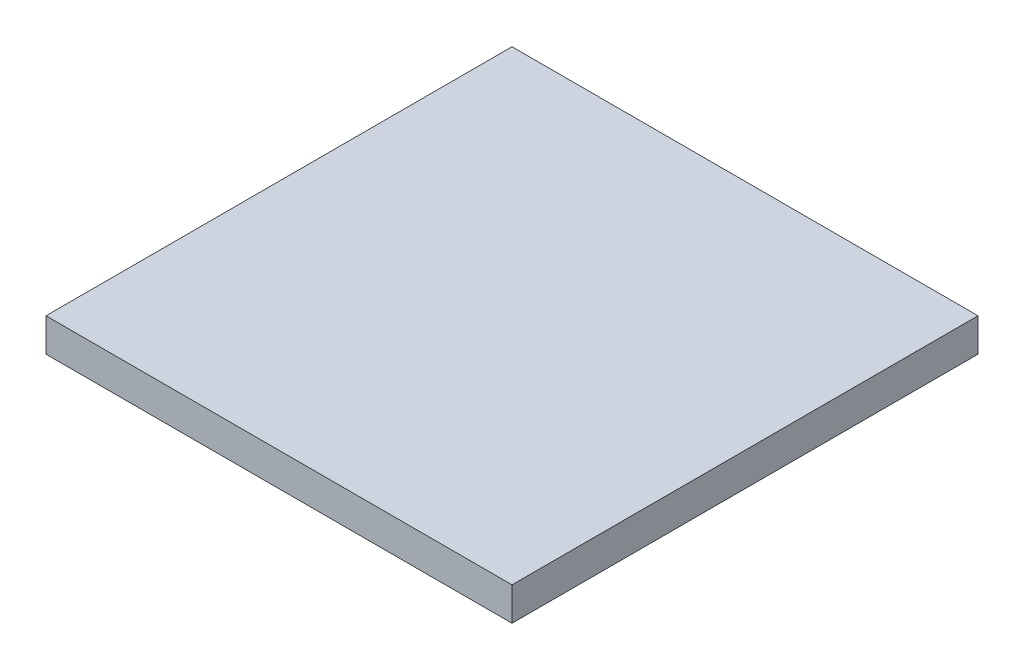
ISO-10303-21;
HEADER;
FILE_DESCRIPTION(('STEP AP214'),'2;1');
FILE_NAME('part.step','',(''),(''),'','','');
FILE_SCHEMA(('AUTOMOTIVE_DESIGN { 1 0 10303 214 1 1 1 1 }'));
ENDSEC;
DATA;
#1=APPLICATION_CONTEXT('core data for automotive mechanical design processes');
#2=APPLICATION_PROTOCOL_DEFINITION('international standard','automotive_design',2000,#1);
#3=PRODUCT_CONTEXT('',#1,'mechanical');
#4=PRODUCT('Part','Part','',(#3));
#5=PRODUCT_RELATED_PRODUCT_CATEGORY('part','',(#4));
#6=PRODUCT_DEFINITION_FORMATION('','',#4);
#7=PRODUCT_DEFINITION_CONTEXT('part definition',#1,'design');
#8=PRODUCT_DEFINITION('design','',#6,#7);
#9=PRODUCT_DEFINITION_SHAPE('','',#8);
#10=(LENGTH_UNIT() NAMED_UNIT(*) SI_UNIT(.MILLI.,.METRE.));
#11=(NAMED_UNIT(*) PLANE_ANGLE_UNIT() SI_UNIT($,.RADIAN.));
#12=(NAMED_UNIT(*) SI_UNIT($,.STERADIAN.) SOLID_ANGLE_UNIT());
#13=UNCERTAINTY_MEASURE_WITH_UNIT(LENGTH_MEASURE(1.E-05),#10,'distance_accuracy_value','');
#14=(GEOMETRIC_REPRESENTATION_CONTEXT(3) GLOBAL_UNCERTAINTY_ASSIGNED_CONTEXT((#13)) GLOBAL_UNIT_ASSIGNED_CONTEXT((#10,
#11,#12)) REPRESENTATION_CONTEXT('',''));
#15=CARTESIAN_POINT('',(0.,0.,0.));
#16=DIRECTION('',(0.,0.,1.));
#17=DIRECTION('',(1.,0.,0.));
#18=AXIS2_PLACEMENT_3D('',#15,#16,#17);
#19=CARTESIAN_POINT('',(-22.4999999999967,-7.44999999998326,3.24999999999243));
#20=DIRECTION('',(-1.,0.,-1.07850236677873E-12));
#21=DIRECTION('',(-1.07850236677873E-12,0.,1.));
#22=AXIS2_PLACEMENT_3D('',#19,#20,#21);
#23=PLANE('',#22);
#24=DIRECTION('',(0.,-1.,0.));
#25=VECTOR('',#24,1.);
#26=CARTESIAN_POINT('',(-22.4999999999892,-6.44999999998326,-3.75000000000755));
#27=LINE('',#26,#25);
#28=CARTESIAN_POINT('',(-22.4999999999892,-6.44999999998326,-3.75000000000755));
#29=VERTEX_POINT('',#28);
#30=CARTESIAN_POINT('',(-22.4999999999892,-7.44999999998325,-3.75000000000755));
#31=VERTEX_POINT('',#30);
#32=EDGE_CURVE('E11',#29,#31,#27,.T.);
#33=ORIENTED_EDGE('',*,*,#32,.T.);
#34=DIRECTION('',(-1.07850236677873E-12,0.,1.));
#35=VECTOR('',#34,1.);
#36=CARTESIAN_POINT('',(-22.4999999999892,-7.44999999998326,-3.75000000000755));
#37=LINE('',#36,#35);
#38=CARTESIAN_POINT('',(-22.5000000000043,-7.44999999998326,10.2499999999924));
#39=VERTEX_POINT('',#38);
#40=EDGE_CURVE('E28',#31,#39,#37,.T.);
#41=ORIENTED_EDGE('',*,*,#40,.T.);
#42=DIRECTION('',(0.,-1.,0.));
#43=VECTOR('',#42,1.);
#44=CARTESIAN_POINT('',(-22.5000000000043,-6.44999999998326,10.2499999999924));
#45=LINE('',#44,#43);
#46=CARTESIAN_POINT('',(-22.5000000000043,-6.44999999998326,10.2499999999924));
#47=VERTEX_POINT('',#46);
#48=EDGE_CURVE('E68',#47,#39,#45,.T.);
#49=ORIENTED_EDGE('',*,*,#48,.F.);
#50=DIRECTION('',(-1.07850236677873E-12,0.,1.));
#51=VECTOR('',#50,1.);
#52=CARTESIAN_POINT('',(-22.4999999999892,-6.44999999998326,-3.75000000000755));
#53=LINE('',#52,#51);
#54=EDGE_CURVE('E64',#29,#47,#53,.T.);
#55=ORIENTED_EDGE('',*,*,#54,.F.);
#56=EDGE_LOOP('',(#33,#41,#49,#55));
#57=FACE_BOUND('',#56,.T.);
#58=ADVANCED_FACE('F17',(#57),#23,.T.);
#59=CARTESIAN_POINT('',(-15.4999999999892,-7.44999999998326,-3.75));
#60=DIRECTION('',(1.07929538322488E-12,0.,-1.));
#61=DIRECTION('',(0.,-1.,0.));
#62=AXIS2_PLACEMENT_3D('',#59,#60,#61);
#63=PLANE('',#62);
#64=DIRECTION('',(0.,-1.,0.));
#65=VECTOR('',#64,1.);
#66=CARTESIAN_POINT('',(-8.4999999999892,-6.44999999998325,-3.74999999999245));
#67=LINE('',#66,#65);
#68=CARTESIAN_POINT('',(-8.4999999999892,-6.44999999998325,-3.74999999999245));
#69=VERTEX_POINT('',#68);
#70=CARTESIAN_POINT('',(-8.49999999998919,-7.44999999998325,-3.74999999999243));
#71=VERTEX_POINT('',#70);
#72=EDGE_CURVE('E100',#69,#71,#67,.T.);
#73=ORIENTED_EDGE('',*,*,#72,.T.);
#74=DIRECTION('',(-1.,0.,-1.07996944720412E-12));
#75=VECTOR('',#74,1.);
#76=CARTESIAN_POINT('',(-8.49999999998919,-7.44999999998325,-3.74999999999243));
#77=LINE('',#76,#75);
#78=EDGE_CURVE('E96',#71,#31,#77,.T.);
#79=ORIENTED_EDGE('',*,*,#78,.T.);
#80=ORIENTED_EDGE('',*,*,#32,.F.);
#81=DIRECTION('',(-1.,0.,-1.07854201760103E-12));
#82=VECTOR('',#81,1.);
#83=CARTESIAN_POINT('',(-8.4999999999892,-6.44999999998325,-3.74999999999245));
#84=LINE('',#83,#82);
#85=EDGE_CURVE('E82',#69,#29,#84,.T.);
#86=ORIENTED_EDGE('',*,*,#85,.F.);
#87=EDGE_LOOP('',(#73,#79,#80,#86));
#88=FACE_BOUND('',#87,.T.);
#89=ADVANCED_FACE('F19',(#88),#63,.T.);
#90=CARTESIAN_POINT('',(-8.49999999999675,-7.44999999998325,3.25000000000757));
#91=DIRECTION('',(1.,0.,0.));
#92=DIRECTION('',(0.,-1.07786795362179E-12,1.));
#93=AXIS2_PLACEMENT_3D('',#90,#91,#92);
#94=PLANE('',#93);
#95=DIRECTION('',(0.,1.,0.));
#96=VECTOR('',#95,1.);
#97=CARTESIAN_POINT('',(-8.50000000000429,-7.44999999998325,10.2500000000076));
#98=LINE('',#97,#96);
#99=CARTESIAN_POINT('',(-8.50000000000429,-7.44999999998325,10.2500000000076));
#100=VERTEX_POINT('',#99);
#101=CARTESIAN_POINT('',(-8.50000000000429,-6.44999999998325,10.2500000000076));
#102=VERTEX_POINT('',#101);
#103=EDGE_CURVE('E21',#100,#102,#98,.T.);
#104=ORIENTED_EDGE('',*,*,#103,.F.);
#105=DIRECTION('',(1.07786795362179E-12,0.,-1.));
#106=VECTOR('',#105,1.);
#107=CARTESIAN_POINT('',(-8.50000000000429,-7.44999999998325,10.2500000000076));
#108=LINE('',#107,#106);
#109=EDGE_CURVE('E102',#100,#71,#108,.T.);
#110=ORIENTED_EDGE('',*,*,#109,.T.);
#111=ORIENTED_EDGE('',*,*,#72,.F.);
#112=DIRECTION('',(1.07786795362179E-12,0.,-1.));
#113=VECTOR('',#112,1.);
#114=CARTESIAN_POINT('',(-8.50000000000429,-6.44999999998325,10.2500000000076));
#115=LINE('',#114,#113);
#116=EDGE_CURVE('E73',#102,#69,#115,.T.);
#117=ORIENTED_EDGE('',*,*,#116,.F.);
#118=EDGE_LOOP('',(#104,#110,#111,#117));
#119=FACE_BOUND('',#118,.T.);
#120=ADVANCED_FACE('F122',(#119),#94,.T.);
#121=CARTESIAN_POINT('',(-15.4999999999892,-6.44999999998325,-3.75));
#122=DIRECTION('',(0.,1.,0.));
#123=DIRECTION('',(1.,0.,0.));
#124=AXIS2_PLACEMENT_3D('',#121,#122,#123);
#125=PLANE('',#124);
#126=ORIENTED_EDGE('',*,*,#85,.T.);
#127=ORIENTED_EDGE('',*,*,#54,.T.);
#128=DIRECTION('',(1.,0.,1.08563951479417E-12));
#129=VECTOR('',#128,1.);
#130=CARTESIAN_POINT('',(-22.5000000000043,-6.44999999998326,10.2499999999924));
#131=LINE('',#130,#129);
#132=EDGE_CURVE('E81',#47,#102,#131,.T.);
#133=ORIENTED_EDGE('',*,*,#132,.T.);
#134=ORIENTED_EDGE('',*,*,#116,.T.);
#135=EDGE_LOOP('',(#126,#127,#133,#134));
#136=FACE_BOUND('',#135,.T.);
#137=ADVANCED_FACE('F79',(#136),#125,.T.);
#138=CARTESIAN_POINT('',(-15.5000000000043,-7.44999999998325,10.25));
#139=DIRECTION('',(0.,0.,1.));
#140=DIRECTION('',(1.,1.08563951479417E-12,0.));
#141=AXIS2_PLACEMENT_3D('',#138,#139,#140);
#142=PLANE('',#141);
#143=ORIENTED_EDGE('',*,*,#48,.T.);
#144=DIRECTION('',(1.,0.,1.08563951479417E-12));
#145=VECTOR('',#144,1.);
#146=CARTESIAN_POINT('',(-22.5000000000043,-7.44999999998326,10.2499999999924));
#147=LINE('',#146,#145);
#148=EDGE_CURVE('E74',#39,#100,#147,.T.);
#149=ORIENTED_EDGE('',*,*,#148,.T.);
#150=ORIENTED_EDGE('',*,*,#103,.T.);
#151=ORIENTED_EDGE('',*,*,#132,.F.);
#152=EDGE_LOOP('',(#143,#149,#150,#151));
#153=FACE_BOUND('',#152,.T.);
#154=ADVANCED_FACE('F85',(#153),#142,.T.);
#155=CARTESIAN_POINT('',(-15.4999999999967,-7.44999999998325,-3.75000000000755));
#156=DIRECTION('',(0.,-1.,0.));
#157=DIRECTION('',(0.,0.,-1.));
#158=AXIS2_PLACEMENT_3D('',#155,#156,#157);
#159=PLANE('',#158);
#160=ORIENTED_EDGE('',*,*,#148,.F.);
#161=ORIENTED_EDGE('',*,*,#40,.F.);
#162=ORIENTED_EDGE('',*,*,#78,.F.);
#163=ORIENTED_EDGE('',*,*,#109,.F.);
#164=EDGE_LOOP('',(#160,#161,#162,#163));
#165=FACE_BOUND('',#164,.T.);
#166=ADVANCED_FACE('F124',(#165),#159,.T.);
#167=CLOSED_SHELL('',(#58,#89,#120,#137,#154,#166));
#168=MANIFOLD_SOLID_BREP('B1',#167);
#169=ADVANCED_BREP_SHAPE_REPRESENTATION('',(#18,#168),#14);
#170=SHAPE_DEFINITION_REPRESENTATION(#9,#169);
ENDSEC;
END-ISO-10303-21;
